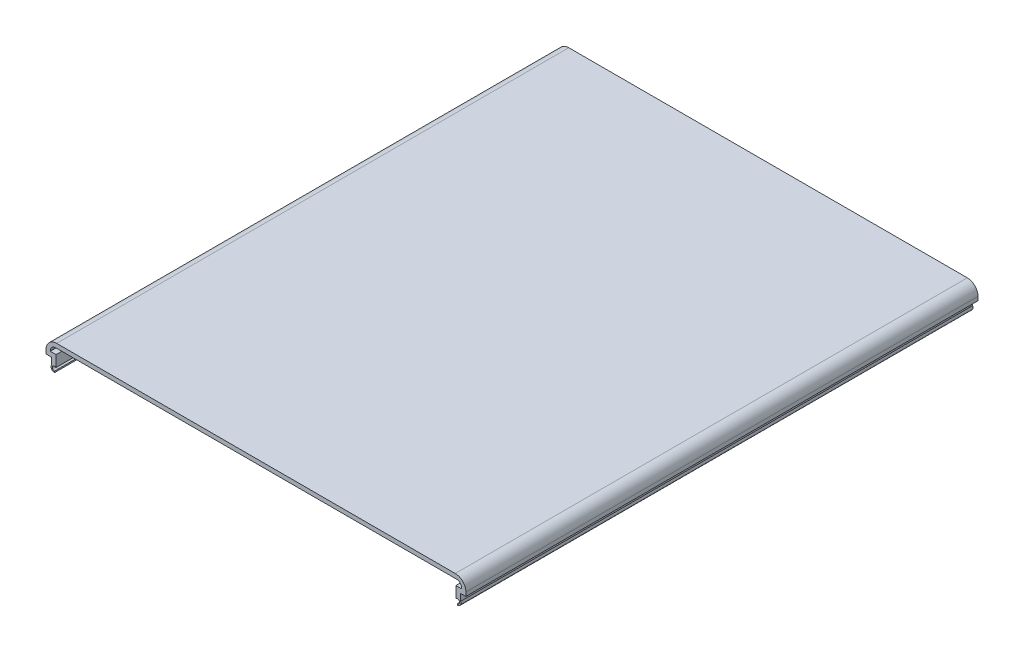
ISO-10303-21;
HEADER;
FILE_DESCRIPTION(('STEP AP214'),'2;1');
FILE_NAME('part.step','',(''),(''),'','','');
FILE_SCHEMA(('AUTOMOTIVE_DESIGN { 1 0 10303 214 1 1 1 1 }'));
ENDSEC;
DATA;
#1=APPLICATION_CONTEXT('core data for automotive mechanical design processes');
#2=APPLICATION_PROTOCOL_DEFINITION('international standard','automotive_design',2000,#1);
#3=PRODUCT_CONTEXT('',#1,'mechanical');
#4=PRODUCT('Part','Part','',(#3));
#5=PRODUCT_RELATED_PRODUCT_CATEGORY('part','',(#4));
#6=PRODUCT_DEFINITION_FORMATION('','',#4);
#7=PRODUCT_DEFINITION_CONTEXT('part definition',#1,'design');
#8=PRODUCT_DEFINITION('design','',#6,#7);
#9=PRODUCT_DEFINITION_SHAPE('','',#8);
#10=(LENGTH_UNIT() NAMED_UNIT(*) SI_UNIT(.MILLI.,.METRE.));
#11=(NAMED_UNIT(*) PLANE_ANGLE_UNIT() SI_UNIT($,.RADIAN.));
#12=(NAMED_UNIT(*) SI_UNIT($,.STERADIAN.) SOLID_ANGLE_UNIT());
#13=UNCERTAINTY_MEASURE_WITH_UNIT(LENGTH_MEASURE(1.E-05),#10,'distance_accuracy_value','');
#14=(GEOMETRIC_REPRESENTATION_CONTEXT(3) GLOBAL_UNCERTAINTY_ASSIGNED_CONTEXT((#13)) GLOBAL_UNIT_ASSIGNED_CONTEXT((#10,
#11,#12)) REPRESENTATION_CONTEXT('',''));
#15=CARTESIAN_POINT('',(0.,0.,0.));
#16=DIRECTION('',(0.,0.,1.));
#17=DIRECTION('',(1.,0.,0.));
#18=AXIS2_PLACEMENT_3D('',#15,#16,#17);
#19=CARTESIAN_POINT('',(-122.428,-6.00422078663732,304.8));
#20=DIRECTION('',(-1.,0.,0.));
#21=DIRECTION('',(0.,0.,1.));
#22=AXIS2_PLACEMENT_3D('',#19,#20,#21);
#23=PLANE('',#22);
#24=DIRECTION('',(0.,1.,0.));
#25=VECTOR('',#24,1.);
#26=CARTESIAN_POINT('',(-122.428,-6.00422078663732,0.));
#27=LINE('',#26,#25);
#28=CARTESIAN_POINT('',(-122.428,-6.00422078663732,0.));
#29=VERTEX_POINT('',#28);
#30=CARTESIAN_POINT('',(-122.428,-5.71500000000003,0.));
#31=VERTEX_POINT('',#30);
#32=EDGE_CURVE('E236',#29,#31,#27,.T.);
#33=ORIENTED_EDGE('',*,*,#32,.T.);
#34=DIRECTION('',(0.,0.,-1.));
#35=VECTOR('',#34,1.);
#36=CARTESIAN_POINT('',(-122.428,-5.71500000000003,304.8));
#37=LINE('',#36,#35);
#38=CARTESIAN_POINT('',(-122.428,-5.71500000000003,304.8));
#39=VERTEX_POINT('',#38);
#40=EDGE_CURVE('E11',#39,#31,#37,.T.);
#41=ORIENTED_EDGE('',*,*,#40,.F.);
#42=DIRECTION('',(0.,1.,0.));
#43=VECTOR('',#42,1.);
#44=CARTESIAN_POINT('',(-122.428,-6.00422078663732,304.8));
#45=LINE('',#44,#43);
#46=CARTESIAN_POINT('',(-122.428,-6.00422078663732,304.8));
#47=VERTEX_POINT('',#46);
#48=EDGE_CURVE('E286',#47,#39,#45,.T.);
#49=ORIENTED_EDGE('',*,*,#48,.F.);
#50=DIRECTION('',(0.,0.,-1.));
#51=VECTOR('',#50,1.);
#52=CARTESIAN_POINT('',(-122.428,-6.00422078663732,304.8));
#53=LINE('',#52,#51);
#54=EDGE_CURVE('E232',#47,#29,#53,.T.);
#55=ORIENTED_EDGE('',*,*,#54,.T.);
#56=EDGE_LOOP('',(#33,#41,#49,#55));
#57=FACE_BOUND('',#56,.T.);
#58=ADVANCED_FACE('F32',(#57),#23,.F.);
#59=CARTESIAN_POINT('',(-119.253,-5.71500000000003,304.8));
#60=DIRECTION('',(0.,0.,-1.));
#61=DIRECTION('',(-1.,0.,0.));
#62=AXIS2_PLACEMENT_3D('',#59,#60,#61);
#63=CYLINDRICAL_SURFACE('',#62,3.17499999999998);
#64=CARTESIAN_POINT('',(-119.253,-5.71500000000003,0.));
#65=DIRECTION('',(0.,0.,-1.));
#66=DIRECTION('',(-1.,0.,0.));
#67=AXIS2_PLACEMENT_3D('',#64,#65,#66);
#68=CIRCLE('',#67,3.17499999999998);
#69=CARTESIAN_POINT('',(-119.253,-2.54000000000006,0.));
#70=VERTEX_POINT('',#69);
#71=EDGE_CURVE('E239',#31,#70,#68,.T.);
#72=ORIENTED_EDGE('',*,*,#71,.T.);
#73=DIRECTION('',(0.,0.,-1.));
#74=VECTOR('',#73,1.);
#75=CARTESIAN_POINT('',(-119.253,-2.54000000000006,304.8));
#76=LINE('',#75,#74);
#77=CARTESIAN_POINT('',(-119.253,-2.54000000000006,304.8));
#78=VERTEX_POINT('',#77);
#79=EDGE_CURVE('E40',#78,#70,#76,.T.);
#80=ORIENTED_EDGE('',*,*,#79,.F.);
#81=CARTESIAN_POINT('',(-119.253,-5.71500000000003,304.8));
#82=DIRECTION('',(0.,0.,-1.));
#83=DIRECTION('',(-1.,0.,0.));
#84=AXIS2_PLACEMENT_3D('',#81,#82,#83);
#85=CIRCLE('',#84,3.17499999999998);
#86=EDGE_CURVE('E145',#39,#78,#85,.T.);
#87=ORIENTED_EDGE('',*,*,#86,.F.);
#88=ORIENTED_EDGE('',*,*,#40,.T.);
#89=EDGE_LOOP('',(#72,#80,#87,#88));
#90=FACE_BOUND('',#89,.T.);
#91=ADVANCED_FACE('F434',(#90),#63,.F.);
#92=CARTESIAN_POINT('',(-119.253,-2.54000000000006,304.8));
#93=DIRECTION('',(0.,1.,0.));
#94=DIRECTION('',(-1.,0.,0.));
#95=AXIS2_PLACEMENT_3D('',#92,#93,#94);
#96=PLANE('',#95);
#97=DIRECTION('',(1.,0.,0.));
#98=VECTOR('',#97,1.);
#99=CARTESIAN_POINT('',(-119.253,-2.54000000000006,0.));
#100=LINE('',#99,#98);
#101=CARTESIAN_POINT('',(119.253,-2.54000000000002,0.));
#102=VERTEX_POINT('',#101);
#103=EDGE_CURVE('E241',#70,#102,#100,.T.);
#104=ORIENTED_EDGE('',*,*,#103,.T.);
#105=DIRECTION('',(0.,0.,-1.));
#106=VECTOR('',#105,1.);
#107=CARTESIAN_POINT('',(119.253,-2.54000000000002,304.8));
#108=LINE('',#107,#106);
#109=CARTESIAN_POINT('',(119.253,-2.54000000000002,304.8));
#110=VERTEX_POINT('',#109);
#111=EDGE_CURVE('E347',#110,#102,#108,.T.);
#112=ORIENTED_EDGE('',*,*,#111,.F.);
#113=DIRECTION('',(1.,0.,0.));
#114=VECTOR('',#113,1.);
#115=CARTESIAN_POINT('',(-119.253,-2.54000000000006,304.8));
#116=LINE('',#115,#114);
#117=EDGE_CURVE('E355',#78,#110,#116,.T.);
#118=ORIENTED_EDGE('',*,*,#117,.F.);
#119=ORIENTED_EDGE('',*,*,#79,.T.);
#120=EDGE_LOOP('',(#104,#112,#118,#119));
#121=FACE_BOUND('',#120,.T.);
#122=ADVANCED_FACE('F353',(#121),#96,.F.);
#123=CARTESIAN_POINT('',(119.253,-5.715,304.8));
#124=DIRECTION('',(0.,0.,-1.));
#125=DIRECTION('',(-1.,0.,0.));
#126=AXIS2_PLACEMENT_3D('',#123,#124,#125);
#127=CYLINDRICAL_SURFACE('',#126,3.17499999999998);
#128=CARTESIAN_POINT('',(119.253,-5.715,0.));
#129=DIRECTION('',(0.,0.,-1.));
#130=DIRECTION('',(1.,0.,0.));
#131=AXIS2_PLACEMENT_3D('',#128,#129,#130);
#132=CIRCLE('',#131,3.17499999999998);
#133=CARTESIAN_POINT('',(122.428,-5.715,0.));
#134=VERTEX_POINT('',#133);
#135=EDGE_CURVE('E243',#102,#134,#132,.T.);
#136=ORIENTED_EDGE('',*,*,#135,.T.);
#137=DIRECTION('',(0.,0.,-1.));
#138=VECTOR('',#137,1.);
#139=CARTESIAN_POINT('',(122.428,-5.715,304.8));
#140=LINE('',#139,#138);
#141=CARTESIAN_POINT('',(122.428,-5.715,304.8));
#142=VERTEX_POINT('',#141);
#143=EDGE_CURVE('E344',#142,#134,#140,.T.);
#144=ORIENTED_EDGE('',*,*,#143,.F.);
#145=CARTESIAN_POINT('',(119.253,-5.715,304.8));
#146=DIRECTION('',(0.,0.,-1.));
#147=DIRECTION('',(1.,0.,0.));
#148=AXIS2_PLACEMENT_3D('',#145,#146,#147);
#149=CIRCLE('',#148,3.17499999999998);
#150=EDGE_CURVE('E373',#110,#142,#149,.T.);
#151=ORIENTED_EDGE('',*,*,#150,.F.);
#152=ORIENTED_EDGE('',*,*,#111,.T.);
#153=EDGE_LOOP('',(#136,#144,#151,#152));
#154=FACE_BOUND('',#153,.T.);
#155=ADVANCED_FACE('F364',(#154),#127,.F.);
#156=CARTESIAN_POINT('',(122.428,-6.00422078663729,304.8));
#157=DIRECTION('',(1.,0.,0.));
#158=DIRECTION('',(0.,0.,-1.));
#159=AXIS2_PLACEMENT_3D('',#156,#157,#158);
#160=PLANE('',#159);
#161=DIRECTION('',(0.,-1.,0.));
#162=VECTOR('',#161,1.);
#163=CARTESIAN_POINT('',(122.428,-6.00422078663729,0.));
#164=LINE('',#163,#162);
#165=CARTESIAN_POINT('',(122.428,-6.00422078663729,0.));
#166=VERTEX_POINT('',#165);
#167=EDGE_CURVE('E245',#134,#166,#164,.T.);
#168=ORIENTED_EDGE('',*,*,#167,.T.);
#169=DIRECTION('',(0.,0.,-1.));
#170=VECTOR('',#169,1.);
#171=CARTESIAN_POINT('',(122.428,-6.00422078663729,304.8));
#172=LINE('',#171,#170);
#173=CARTESIAN_POINT('',(122.428,-6.00422078663729,304.8));
#174=VERTEX_POINT('',#173);
#175=EDGE_CURVE('E341',#174,#166,#172,.T.);
#176=ORIENTED_EDGE('',*,*,#175,.F.);
#177=DIRECTION('',(0.,-1.,0.));
#178=VECTOR('',#177,1.);
#179=CARTESIAN_POINT('',(122.428,-6.00422078663729,304.8));
#180=LINE('',#179,#178);
#181=EDGE_CURVE('E370',#142,#174,#180,.T.);
#182=ORIENTED_EDGE('',*,*,#181,.F.);
#183=ORIENTED_EDGE('',*,*,#143,.T.);
#184=EDGE_LOOP('',(#168,#176,#182,#183));
#185=FACE_BOUND('',#184,.T.);
#186=ADVANCED_FACE('F368',(#185),#160,.F.);
#187=CARTESIAN_POINT('',(118.992266473634,-6.00422078663729,304.8));
#188=DIRECTION('',(0.,-1.,0.));
#189=DIRECTION('',(0.,0.,-1.));
#190=AXIS2_PLACEMENT_3D('',#187,#188,#189);
#191=PLANE('',#190);
#192=DIRECTION('',(-1.,0.,0.));
#193=VECTOR('',#192,1.);
#194=CARTESIAN_POINT('',(118.992266473634,-6.00422078663729,0.));
#195=LINE('',#194,#193);
#196=CARTESIAN_POINT('',(118.992266473634,-6.00422078663729,0.));
#197=VERTEX_POINT('',#196);
#198=EDGE_CURVE('E247',#166,#197,#195,.T.);
#199=ORIENTED_EDGE('',*,*,#198,.T.);
#200=DIRECTION('',(0.,0.,-1.));
#201=VECTOR('',#200,1.);
#202=CARTESIAN_POINT('',(118.992266473634,-6.00422078663729,304.8));
#203=LINE('',#202,#201);
#204=CARTESIAN_POINT('',(118.992266473634,-6.00422078663729,304.8));
#205=VERTEX_POINT('',#204);
#206=EDGE_CURVE('E338',#205,#197,#203,.T.);
#207=ORIENTED_EDGE('',*,*,#206,.F.);
#208=DIRECTION('',(-1.,0.,0.));
#209=VECTOR('',#208,1.);
#210=CARTESIAN_POINT('',(118.992266473634,-6.00422078663729,304.8));
#211=LINE('',#210,#209);
#212=EDGE_CURVE('E372',#174,#205,#211,.T.);
#213=ORIENTED_EDGE('',*,*,#212,.F.);
#214=ORIENTED_EDGE('',*,*,#175,.T.);
#215=EDGE_LOOP('',(#199,#207,#213,#214));
#216=FACE_BOUND('',#215,.T.);
#217=ADVANCED_FACE('F447',(#216),#191,.F.);
#218=CARTESIAN_POINT('',(118.992266473634,-12.6219946945985,304.8));
#219=DIRECTION('',(1.,0.,0.));
#220=DIRECTION('',(0.,0.,-1.));
#221=AXIS2_PLACEMENT_3D('',#218,#219,#220);
#222=PLANE('',#221);
#223=DIRECTION('',(0.,-1.,0.));
#224=VECTOR('',#223,1.);
#225=CARTESIAN_POINT('',(118.992266473634,-12.6219946945985,0.));
#226=LINE('',#225,#224);
#227=CARTESIAN_POINT('',(118.992266473634,-12.6219946945985,0.));
#228=VERTEX_POINT('',#227);
#229=EDGE_CURVE('E249',#197,#228,#226,.T.);
#230=ORIENTED_EDGE('',*,*,#229,.T.);
#231=DIRECTION('',(0.,0.,-1.));
#232=VECTOR('',#231,1.);
#233=CARTESIAN_POINT('',(118.992266473634,-12.6219946945985,304.8));
#234=LINE('',#233,#232);
#235=CARTESIAN_POINT('',(118.992266473634,-12.6219946945985,304.8));
#236=VERTEX_POINT('',#235);
#237=EDGE_CURVE('E335',#236,#228,#234,.T.);
#238=ORIENTED_EDGE('',*,*,#237,.F.);
#239=DIRECTION('',(0.,-1.,0.));
#240=VECTOR('',#239,1.);
#241=CARTESIAN_POINT('',(118.992266473634,-12.6219946945985,304.8));
#242=LINE('',#241,#240);
#243=EDGE_CURVE('E375',#205,#236,#242,.T.);
#244=ORIENTED_EDGE('',*,*,#243,.F.);
#245=ORIENTED_EDGE('',*,*,#206,.T.);
#246=EDGE_LOOP('',(#230,#238,#244,#245));
#247=FACE_BOUND('',#246,.T.);
#248=ADVANCED_FACE('F450',(#247),#222,.F.);
#249=CARTESIAN_POINT('',(119.146762684132,-12.6219946945985,304.8));
#250=DIRECTION('',(0.,1.,0.));
#251=DIRECTION('',(0.,0.,1.));
#252=AXIS2_PLACEMENT_3D('',#249,#250,#251);
#253=PLANE('',#252);
#254=DIRECTION('',(1.,0.,0.));
#255=VECTOR('',#254,1.);
#256=CARTESIAN_POINT('',(119.146762684132,-12.6219946945985,0.));
#257=LINE('',#256,#255);
#258=CARTESIAN_POINT('',(119.146762684132,-12.6219946945986,0.));
#259=VERTEX_POINT('',#258);
#260=EDGE_CURVE('E251',#228,#259,#257,.T.);
#261=ORIENTED_EDGE('',*,*,#260,.T.);
#262=DIRECTION('',(0.,0.,-1.));
#263=VECTOR('',#262,1.);
#264=CARTESIAN_POINT('',(119.146762684132,-12.6219946945986,304.8));
#265=LINE('',#264,#263);
#266=CARTESIAN_POINT('',(119.146762684132,-12.6219946945986,304.8));
#267=VERTEX_POINT('',#266);
#268=EDGE_CURVE('E332',#267,#259,#265,.T.);
#269=ORIENTED_EDGE('',*,*,#268,.F.);
#270=DIRECTION('',(1.,0.,0.));
#271=VECTOR('',#270,1.);
#272=CARTESIAN_POINT('',(119.146762684132,-12.6219946945985,304.8));
#273=LINE('',#272,#271);
#274=EDGE_CURVE('E381',#236,#267,#273,.T.);
#275=ORIENTED_EDGE('',*,*,#274,.F.);
#276=ORIENTED_EDGE('',*,*,#237,.T.);
#277=EDGE_LOOP('',(#261,#269,#275,#276));
#278=FACE_BOUND('',#277,.T.);
#279=ADVANCED_FACE('F454',(#278),#253,.F.);
#280=CARTESIAN_POINT('',(119.888,-13.653240175347,304.8));
#281=DIRECTION('',(0.,0.,-1.));
#282=DIRECTION('',(-1.,0.,0.));
#283=AXIS2_PLACEMENT_3D('',#280,#281,#282);
#284=CYLINDRICAL_SURFACE('',#283,1.27);
#285=CARTESIAN_POINT('',(119.888,-13.653240175347,0.));
#286=DIRECTION('',(0.,0.,-1.));
#287=DIRECTION('',(1.,0.,0.));
#288=AXIS2_PLACEMENT_3D('',#285,#286,#287);
#289=CIRCLE('',#288,1.27);
#290=CARTESIAN_POINT('',(119.881210728142,-14.9232220278897,0.));
#291=VERTEX_POINT('',#290);
#292=EDGE_CURVE('E253',#259,#291,#289,.T.);
#293=ORIENTED_EDGE('',*,*,#292,.T.);
#294=DIRECTION('',(0.,0.,-1.));
#295=VECTOR('',#294,1.);
#296=CARTESIAN_POINT('',(119.881210728142,-14.9232220278897,304.8));
#297=LINE('',#296,#295);
#298=CARTESIAN_POINT('',(119.881210728142,-14.9232220278897,304.8));
#299=VERTEX_POINT('',#298);
#300=EDGE_CURVE('E329',#299,#291,#297,.T.);
#301=ORIENTED_EDGE('',*,*,#300,.F.);
#302=CARTESIAN_POINT('',(119.888,-13.653240175347,304.8));
#303=DIRECTION('',(0.,0.,-1.));
#304=DIRECTION('',(1.,0.,0.));
#305=AXIS2_PLACEMENT_3D('',#302,#303,#304);
#306=CIRCLE('',#305,1.27);
#307=EDGE_CURVE('E383',#267,#299,#306,.T.);
#308=ORIENTED_EDGE('',*,*,#307,.F.);
#309=ORIENTED_EDGE('',*,*,#268,.T.);
#310=EDGE_LOOP('',(#293,#301,#308,#309));
#311=FACE_BOUND('',#310,.T.);
#312=ADVANCED_FACE('F458',(#311),#284,.F.);
#313=CARTESIAN_POINT('',(119.888,-15.748740175347,304.8));
#314=DIRECTION('',(0.999966182529296,0.00822397700554112,0.));
#315=DIRECTION('',(-0.00822397700554112,0.999966182529296,0.));
#316=AXIS2_PLACEMENT_3D('',#313,#314,#315);
#317=PLANE('',#316);
#318=DIRECTION('',(0.00822397700554112,-0.999966182529295,0.));
#319=VECTOR('',#318,1.);
#320=CARTESIAN_POINT('',(119.888,-15.748740175347,0.));
#321=LINE('',#320,#319);
#322=CARTESIAN_POINT('',(119.888,-15.748740175347,0.));
#323=VERTEX_POINT('',#322);
#324=EDGE_CURVE('E255',#291,#323,#321,.T.);
#325=ORIENTED_EDGE('',*,*,#324,.T.);
#326=DIRECTION('',(0.,0.,-1.));
#327=VECTOR('',#326,1.);
#328=CARTESIAN_POINT('',(119.888,-15.748740175347,304.8));
#329=LINE('',#328,#327);
#330=CARTESIAN_POINT('',(119.888,-15.748740175347,304.8));
#331=VERTEX_POINT('',#330);
#332=EDGE_CURVE('E326',#331,#323,#329,.T.);
#333=ORIENTED_EDGE('',*,*,#332,.F.);
#334=DIRECTION('',(0.00822397700554112,-0.999966182529295,0.));
#335=VECTOR('',#334,1.);
#336=CARTESIAN_POINT('',(119.888,-15.748740175347,304.8));
#337=LINE('',#336,#335);
#338=EDGE_CURVE('E385',#299,#331,#337,.T.);
#339=ORIENTED_EDGE('',*,*,#338,.F.);
#340=ORIENTED_EDGE('',*,*,#300,.T.);
#341=EDGE_LOOP('',(#325,#333,#339,#340));
#342=FACE_BOUND('',#341,.T.);
#343=ADVANCED_FACE('F462',(#342),#317,.F.);
#344=CARTESIAN_POINT('',(119.888,-13.653240175347,304.8));
#345=DIRECTION('',(0.,0.,-1.));
#346=DIRECTION('',(-1.,0.,0.));
#347=AXIS2_PLACEMENT_3D('',#344,#345,#346);
#348=CYLINDRICAL_SURFACE('',#347,2.09549999999999);
#349=CARTESIAN_POINT('',(119.888,-13.653240175347,0.));
#350=DIRECTION('',(0.,0.,1.));
#351=DIRECTION('',(-1.,0.,0.));
#352=AXIS2_PLACEMENT_3D('',#349,#350,#351);
#353=CIRCLE('',#352,2.09549999999999);
#354=CARTESIAN_POINT('',(121.793,-12.7802595054579,0.));
#355=VERTEX_POINT('',#354);
#356=EDGE_CURVE('E257',#323,#355,#353,.T.);
#357=ORIENTED_EDGE('',*,*,#356,.T.);
#358=DIRECTION('',(0.,0.,-1.));
#359=VECTOR('',#358,1.);
#360=CARTESIAN_POINT('',(121.793,-12.7802595054579,304.8));
#361=LINE('',#360,#359);
#362=CARTESIAN_POINT('',(121.793,-12.7802595054579,304.8));
#363=VERTEX_POINT('',#362);
#364=EDGE_CURVE('E323',#363,#355,#361,.T.);
#365=ORIENTED_EDGE('',*,*,#364,.F.);
#366=CARTESIAN_POINT('',(119.888,-13.653240175347,304.8));
#367=DIRECTION('',(0.,0.,1.));
#368=DIRECTION('',(-1.,0.,0.));
#369=AXIS2_PLACEMENT_3D('',#366,#367,#368);
#370=CIRCLE('',#369,2.09549999999999);
#371=EDGE_CURVE('E387',#331,#363,#370,.T.);
#372=ORIENTED_EDGE('',*,*,#371,.F.);
#373=ORIENTED_EDGE('',*,*,#332,.T.);
#374=EDGE_LOOP('',(#357,#365,#372,#373));
#375=FACE_BOUND('',#374,.T.);
#376=ADVANCED_FACE('F466',(#375),#348,.T.);
#377=CARTESIAN_POINT('',(121.793,-8.66545950545794,304.8));
#378=DIRECTION('',(-1.,0.,0.));
#379=DIRECTION('',(0.,0.,1.));
#380=AXIS2_PLACEMENT_3D('',#377,#378,#379);
#381=PLANE('',#380);
#382=DIRECTION('',(0.,1.,0.));
#383=VECTOR('',#382,1.);
#384=CARTESIAN_POINT('',(121.793,-8.66545950545794,0.));
#385=LINE('',#384,#383);
#386=CARTESIAN_POINT('',(121.793,-8.66545950545794,0.));
#387=VERTEX_POINT('',#386);
#388=EDGE_CURVE('E259',#355,#387,#385,.T.);
#389=ORIENTED_EDGE('',*,*,#388,.T.);
#390=DIRECTION('',(0.,0.,-1.));
#391=VECTOR('',#390,1.);
#392=CARTESIAN_POINT('',(121.793,-8.66545950545794,304.8));
#393=LINE('',#392,#391);
#394=CARTESIAN_POINT('',(121.793,-8.66545950545794,304.8));
#395=VERTEX_POINT('',#394);
#396=EDGE_CURVE('E320',#395,#387,#393,.T.);
#397=ORIENTED_EDGE('',*,*,#396,.F.);
#398=DIRECTION('',(0.,1.,0.));
#399=VECTOR('',#398,1.);
#400=CARTESIAN_POINT('',(121.793,-8.66545950545794,304.8));
#401=LINE('',#400,#399);
#402=EDGE_CURVE('E389',#363,#395,#401,.T.);
#403=ORIENTED_EDGE('',*,*,#402,.F.);
#404=ORIENTED_EDGE('',*,*,#364,.T.);
#405=EDGE_LOOP('',(#389,#397,#403,#404));
#406=FACE_BOUND('',#405,.T.);
#407=ADVANCED_FACE('F470',(#406),#381,.F.);
#408=CARTESIAN_POINT('',(124.968,-8.66545950545794,304.8));
#409=DIRECTION('',(0.,1.,0.));
#410=DIRECTION('',(0.,0.,1.));
#411=AXIS2_PLACEMENT_3D('',#408,#409,#410);
#412=PLANE('',#411);
#413=DIRECTION('',(1.,0.,0.));
#414=VECTOR('',#413,1.);
#415=CARTESIAN_POINT('',(124.968,-8.66545950545794,0.));
#416=LINE('',#415,#414);
#417=CARTESIAN_POINT('',(124.968,-8.66545950545794,0.));
#418=VERTEX_POINT('',#417);
#419=EDGE_CURVE('E261',#387,#418,#416,.T.);
#420=ORIENTED_EDGE('',*,*,#419,.T.);
#421=DIRECTION('',(0.,0.,-1.));
#422=VECTOR('',#421,1.);
#423=CARTESIAN_POINT('',(124.968,-8.66545950545794,304.8));
#424=LINE('',#423,#422);
#425=CARTESIAN_POINT('',(124.968,-8.66545950545794,304.8));
#426=VERTEX_POINT('',#425);
#427=EDGE_CURVE('E317',#426,#418,#424,.T.);
#428=ORIENTED_EDGE('',*,*,#427,.F.);
#429=DIRECTION('',(1.,0.,0.));
#430=VECTOR('',#429,1.);
#431=CARTESIAN_POINT('',(124.968,-8.66545950545794,304.8));
#432=LINE('',#431,#430);
#433=EDGE_CURVE('E391',#395,#426,#432,.T.);
#434=ORIENTED_EDGE('',*,*,#433,.F.);
#435=ORIENTED_EDGE('',*,*,#396,.T.);
#436=EDGE_LOOP('',(#420,#428,#434,#435));
#437=FACE_BOUND('',#436,.T.);
#438=ADVANCED_FACE('F474',(#437),#412,.F.);
#439=CARTESIAN_POINT('',(124.968,-6.35000000000001,304.8));
#440=DIRECTION('',(-1.,0.,0.));
#441=DIRECTION('',(0.,-1.,0.));
#442=AXIS2_PLACEMENT_3D('',#439,#440,#441);
#443=PLANE('',#442);
#444=DIRECTION('',(0.,1.,0.));
#445=VECTOR('',#444,1.);
#446=CARTESIAN_POINT('',(124.968,-6.35000000000001,0.));
#447=LINE('',#446,#445);
#448=CARTESIAN_POINT('',(124.968,-6.35000000000002,0.));
#449=VERTEX_POINT('',#448);
#450=EDGE_CURVE('E263',#418,#449,#447,.T.);
#451=ORIENTED_EDGE('',*,*,#450,.T.);
#452=DIRECTION('',(0.,0.,-1.));
#453=VECTOR('',#452,1.);
#454=CARTESIAN_POINT('',(124.968,-6.35000000000002,304.8));
#455=LINE('',#454,#453);
#456=CARTESIAN_POINT('',(124.968,-6.35000000000002,304.8));
#457=VERTEX_POINT('',#456);
#458=EDGE_CURVE('E314',#457,#449,#455,.T.);
#459=ORIENTED_EDGE('',*,*,#458,.F.);
#460=DIRECTION('',(0.,1.,0.));
#461=VECTOR('',#460,1.);
#462=CARTESIAN_POINT('',(124.968,-6.35000000000001,304.8));
#463=LINE('',#462,#461);
#464=EDGE_CURVE('E393',#426,#457,#463,.T.);
#465=ORIENTED_EDGE('',*,*,#464,.F.);
#466=ORIENTED_EDGE('',*,*,#427,.T.);
#467=EDGE_LOOP('',(#451,#459,#465,#466));
#468=FACE_BOUND('',#467,.T.);
#469=ADVANCED_FACE('F478',(#468),#443,.F.);
#470=CARTESIAN_POINT('',(118.618,-6.34999999999997,304.8));
#471=DIRECTION('',(0.,0.,-1.));
#472=DIRECTION('',(-1.,0.,0.));
#473=AXIS2_PLACEMENT_3D('',#470,#471,#472);
#474=CYLINDRICAL_SURFACE('',#473,6.35);
#475=CARTESIAN_POINT('',(118.618,-6.34999999999997,0.));
#476=DIRECTION('',(0.,0.,1.));
#477=DIRECTION('',(1.,0.,0.));
#478=AXIS2_PLACEMENT_3D('',#475,#476,#477);
#479=CIRCLE('',#478,6.35);
#480=CARTESIAN_POINT('',(118.618,0.,0.));
#481=VERTEX_POINT('',#480);
#482=EDGE_CURVE('E265',#449,#481,#479,.T.);
#483=ORIENTED_EDGE('',*,*,#482,.T.);
#484=DIRECTION('',(0.,0.,-1.));
#485=VECTOR('',#484,1.);
#486=CARTESIAN_POINT('',(118.618,0.,304.8));
#487=LINE('',#486,#485);
#488=CARTESIAN_POINT('',(118.618,0.,304.8));
#489=VERTEX_POINT('',#488);
#490=EDGE_CURVE('E311',#489,#481,#487,.T.);
#491=ORIENTED_EDGE('',*,*,#490,.F.);
#492=CARTESIAN_POINT('',(118.618,-6.34999999999997,304.8));
#493=DIRECTION('',(0.,0.,1.));
#494=DIRECTION('',(1.,0.,0.));
#495=AXIS2_PLACEMENT_3D('',#492,#493,#494);
#496=CIRCLE('',#495,6.35);
#497=EDGE_CURVE('E395',#457,#489,#496,.T.);
#498=ORIENTED_EDGE('',*,*,#497,.F.);
#499=ORIENTED_EDGE('',*,*,#458,.T.);
#500=EDGE_LOOP('',(#483,#491,#498,#499));
#501=FACE_BOUND('',#500,.T.);
#502=ADVANCED_FACE('F482',(#501),#474,.T.);
#503=CARTESIAN_POINT('',(-118.618,0.,304.8));
#504=DIRECTION('',(0.,-1.,0.));
#505=DIRECTION('',(1.,0.,0.));
#506=AXIS2_PLACEMENT_3D('',#503,#504,#505);
#507=PLANE('',#506);
#508=DIRECTION('',(-1.,0.,0.));
#509=VECTOR('',#508,1.);
#510=CARTESIAN_POINT('',(-118.618,0.,0.));
#511=LINE('',#510,#509);
#512=CARTESIAN_POINT('',(-118.618,0.,0.));
#513=VERTEX_POINT('',#512);
#514=EDGE_CURVE('E267',#481,#513,#511,.T.);
#515=ORIENTED_EDGE('',*,*,#514,.T.);
#516=DIRECTION('',(0.,0.,-1.));
#517=VECTOR('',#516,1.);
#518=CARTESIAN_POINT('',(-118.618,0.,304.8));
#519=LINE('',#518,#517);
#520=CARTESIAN_POINT('',(-118.618,0.,304.8));
#521=VERTEX_POINT('',#520);
#522=EDGE_CURVE('E308',#521,#513,#519,.T.);
#523=ORIENTED_EDGE('',*,*,#522,.F.);
#524=DIRECTION('',(-1.,0.,0.));
#525=VECTOR('',#524,1.);
#526=CARTESIAN_POINT('',(-118.618,0.,304.8));
#527=LINE('',#526,#525);
#528=EDGE_CURVE('E397',#489,#521,#527,.T.);
#529=ORIENTED_EDGE('',*,*,#528,.F.);
#530=ORIENTED_EDGE('',*,*,#490,.T.);
#531=EDGE_LOOP('',(#515,#523,#529,#530));
#532=FACE_BOUND('',#531,.T.);
#533=ADVANCED_FACE('F486',(#532),#507,.F.);
#534=CARTESIAN_POINT('',(-118.618,-6.35,304.8));
#535=DIRECTION('',(0.,0.,-1.));
#536=DIRECTION('',(-1.,0.,0.));
#537=AXIS2_PLACEMENT_3D('',#534,#535,#536);
#538=CYLINDRICAL_SURFACE('',#537,6.35);
#539=CARTESIAN_POINT('',(-118.618,-6.35,0.));
#540=DIRECTION('',(0.,0.,1.));
#541=DIRECTION('',(-1.,0.,0.));
#542=AXIS2_PLACEMENT_3D('',#539,#540,#541);
#543=CIRCLE('',#542,6.35);
#544=CARTESIAN_POINT('',(-124.968,-6.35000000000004,0.));
#545=VERTEX_POINT('',#544);
#546=EDGE_CURVE('E269',#513,#545,#543,.T.);
#547=ORIENTED_EDGE('',*,*,#546,.T.);
#548=DIRECTION('',(0.,0.,-1.));
#549=VECTOR('',#548,1.);
#550=CARTESIAN_POINT('',(-124.968,-6.35000000000004,304.8));
#551=LINE('',#550,#549);
#552=CARTESIAN_POINT('',(-124.968,-6.35000000000004,304.8));
#553=VERTEX_POINT('',#552);
#554=EDGE_CURVE('E305',#553,#545,#551,.T.);
#555=ORIENTED_EDGE('',*,*,#554,.F.);
#556=CARTESIAN_POINT('',(-118.618,-6.35,304.8));
#557=DIRECTION('',(0.,0.,1.));
#558=DIRECTION('',(-1.,0.,0.));
#559=AXIS2_PLACEMENT_3D('',#556,#557,#558);
#560=CIRCLE('',#559,6.35);
#561=EDGE_CURVE('E399',#521,#553,#560,.T.);
#562=ORIENTED_EDGE('',*,*,#561,.F.);
#563=ORIENTED_EDGE('',*,*,#522,.T.);
#564=EDGE_LOOP('',(#547,#555,#562,#563));
#565=FACE_BOUND('',#564,.T.);
#566=ADVANCED_FACE('F490',(#565),#538,.T.);
#567=CARTESIAN_POINT('',(-124.968,-6.35000000000004,304.8));
#568=DIRECTION('',(1.,0.,0.));
#569=DIRECTION('',(0.,1.,0.));
#570=AXIS2_PLACEMENT_3D('',#567,#568,#569);
#571=PLANE('',#570);
#572=DIRECTION('',(0.,-1.,0.));
#573=VECTOR('',#572,1.);
#574=CARTESIAN_POINT('',(-124.968,-6.35000000000004,0.));
#575=LINE('',#574,#573);
#576=CARTESIAN_POINT('',(-124.968,-8.66545950545797,0.));
#577=VERTEX_POINT('',#576);
#578=EDGE_CURVE('E271',#545,#577,#575,.T.);
#579=ORIENTED_EDGE('',*,*,#578,.T.);
#580=DIRECTION('',(0.,0.,-1.));
#581=VECTOR('',#580,1.);
#582=CARTESIAN_POINT('',(-124.968,-8.66545950545797,304.8));
#583=LINE('',#582,#581);
#584=CARTESIAN_POINT('',(-124.968,-8.66545950545797,304.8));
#585=VERTEX_POINT('',#584);
#586=EDGE_CURVE('E302',#585,#577,#583,.T.);
#587=ORIENTED_EDGE('',*,*,#586,.F.);
#588=DIRECTION('',(0.,-1.,0.));
#589=VECTOR('',#588,1.);
#590=CARTESIAN_POINT('',(-124.968,-6.35000000000004,304.8));
#591=LINE('',#590,#589);
#592=EDGE_CURVE('E401',#553,#585,#591,.T.);
#593=ORIENTED_EDGE('',*,*,#592,.F.);
#594=ORIENTED_EDGE('',*,*,#554,.T.);
#595=EDGE_LOOP('',(#579,#587,#593,#594));
#596=FACE_BOUND('',#595,.T.);
#597=ADVANCED_FACE('F494',(#596),#571,.F.);
#598=CARTESIAN_POINT('',(-124.968,-8.66545950545797,304.8));
#599=DIRECTION('',(0.,1.,0.));
#600=DIRECTION('',(0.,0.,1.));
#601=AXIS2_PLACEMENT_3D('',#598,#599,#600);
#602=PLANE('',#601);
#603=DIRECTION('',(1.,0.,0.));
#604=VECTOR('',#603,1.);
#605=CARTESIAN_POINT('',(-124.968,-8.66545950545797,0.));
#606=LINE('',#605,#604);
#607=CARTESIAN_POINT('',(-121.793,-8.66545950545797,0.));
#608=VERTEX_POINT('',#607);
#609=EDGE_CURVE('E273',#577,#608,#606,.T.);
#610=ORIENTED_EDGE('',*,*,#609,.T.);
#611=DIRECTION('',(0.,0.,-1.));
#612=VECTOR('',#611,1.);
#613=CARTESIAN_POINT('',(-121.793,-8.66545950545797,304.8));
#614=LINE('',#613,#612);
#615=CARTESIAN_POINT('',(-121.793,-8.66545950545797,304.8));
#616=VERTEX_POINT('',#615);
#617=EDGE_CURVE('E299',#616,#608,#614,.T.);
#618=ORIENTED_EDGE('',*,*,#617,.F.);
#619=DIRECTION('',(1.,0.,0.));
#620=VECTOR('',#619,1.);
#621=CARTESIAN_POINT('',(-124.968,-8.66545950545797,304.8));
#622=LINE('',#621,#620);
#623=EDGE_CURVE('E403',#585,#616,#622,.T.);
#624=ORIENTED_EDGE('',*,*,#623,.F.);
#625=ORIENTED_EDGE('',*,*,#586,.T.);
#626=EDGE_LOOP('',(#610,#618,#624,#625));
#627=FACE_BOUND('',#626,.T.);
#628=ADVANCED_FACE('F498',(#627),#602,.F.);
#629=CARTESIAN_POINT('',(-121.793,-8.66545950545797,304.8));
#630=DIRECTION('',(1.,0.,0.));
#631=DIRECTION('',(0.,0.,-1.));
#632=AXIS2_PLACEMENT_3D('',#629,#630,#631);
#633=PLANE('',#632);
#634=DIRECTION('',(0.,-1.,0.));
#635=VECTOR('',#634,1.);
#636=CARTESIAN_POINT('',(-121.793,-8.66545950545797,0.));
#637=LINE('',#636,#635);
#638=CARTESIAN_POINT('',(-121.793,-12.780259505458,0.));
#639=VERTEX_POINT('',#638);
#640=EDGE_CURVE('E275',#608,#639,#637,.T.);
#641=ORIENTED_EDGE('',*,*,#640,.T.);
#642=DIRECTION('',(0.,0.,-1.));
#643=VECTOR('',#642,1.);
#644=CARTESIAN_POINT('',(-121.793,-12.780259505458,304.8));
#645=LINE('',#644,#643);
#646=CARTESIAN_POINT('',(-121.793,-12.780259505458,304.8));
#647=VERTEX_POINT('',#646);
#648=EDGE_CURVE('E296',#647,#639,#645,.T.);
#649=ORIENTED_EDGE('',*,*,#648,.F.);
#650=DIRECTION('',(0.,-1.,0.));
#651=VECTOR('',#650,1.);
#652=CARTESIAN_POINT('',(-121.793,-8.66545950545797,304.8));
#653=LINE('',#652,#651);
#654=EDGE_CURVE('E405',#616,#647,#653,.T.);
#655=ORIENTED_EDGE('',*,*,#654,.F.);
#656=ORIENTED_EDGE('',*,*,#617,.T.);
#657=EDGE_LOOP('',(#641,#649,#655,#656));
#658=FACE_BOUND('',#657,.T.);
#659=ADVANCED_FACE('F502',(#658),#633,.F.);
#660=CARTESIAN_POINT('',(-119.888,-13.653240175347,304.8));
#661=DIRECTION('',(0.,0.,-1.));
#662=DIRECTION('',(-1.,0.,0.));
#663=AXIS2_PLACEMENT_3D('',#660,#661,#662);
#664=CYLINDRICAL_SURFACE('',#663,2.09549999999999);
#665=CARTESIAN_POINT('',(-119.888,-13.653240175347,0.));
#666=DIRECTION('',(0.,0.,1.));
#667=DIRECTION('',(1.,0.,0.));
#668=AXIS2_PLACEMENT_3D('',#665,#666,#667);
#669=CIRCLE('',#668,2.09549999999999);
#670=CARTESIAN_POINT('',(-119.888,-15.7487401753471,0.));
#671=VERTEX_POINT('',#670);
#672=EDGE_CURVE('E277',#639,#671,#669,.T.);
#673=ORIENTED_EDGE('',*,*,#672,.T.);
#674=DIRECTION('',(0.,0.,-1.));
#675=VECTOR('',#674,1.);
#676=CARTESIAN_POINT('',(-119.888,-15.7487401753471,304.8));
#677=LINE('',#676,#675);
#678=CARTESIAN_POINT('',(-119.888,-15.7487401753471,304.8));
#679=VERTEX_POINT('',#678);
#680=EDGE_CURVE('E293',#679,#671,#677,.T.);
#681=ORIENTED_EDGE('',*,*,#680,.F.);
#682=CARTESIAN_POINT('',(-119.888,-13.653240175347,304.8));
#683=DIRECTION('',(0.,0.,1.));
#684=DIRECTION('',(1.,0.,0.));
#685=AXIS2_PLACEMENT_3D('',#682,#683,#684);
#686=CIRCLE('',#685,2.09549999999999);
#687=EDGE_CURVE('E407',#647,#679,#686,.T.);
#688=ORIENTED_EDGE('',*,*,#687,.F.);
#689=ORIENTED_EDGE('',*,*,#648,.T.);
#690=EDGE_LOOP('',(#673,#681,#688,#689));
#691=FACE_BOUND('',#690,.T.);
#692=ADVANCED_FACE('F506',(#691),#664,.T.);
#693=CARTESIAN_POINT('',(-119.888,-15.7487401753471,304.8));
#694=DIRECTION('',(-0.999966182529295,0.00822397700557476,0.));
#695=DIRECTION('',(-0.00822397700557476,-0.999966182529295,0.));
#696=AXIS2_PLACEMENT_3D('',#693,#694,#695);
#697=PLANE('',#696);
#698=DIRECTION('',(0.00822397700557476,0.999966182529295,0.));
#699=VECTOR('',#698,1.);
#700=CARTESIAN_POINT('',(-119.888,-15.7487401753471,0.));
#701=LINE('',#700,#699);
#702=CARTESIAN_POINT('',(-119.881210728142,-14.9232220278897,0.));
#703=VERTEX_POINT('',#702);
#704=EDGE_CURVE('E279',#671,#703,#701,.T.);
#705=ORIENTED_EDGE('',*,*,#704,.T.);
#706=DIRECTION('',(0.,0.,-1.));
#707=VECTOR('',#706,1.);
#708=CARTESIAN_POINT('',(-119.881210728142,-14.9232220278897,304.8));
#709=LINE('',#708,#707);
#710=CARTESIAN_POINT('',(-119.881210728142,-14.9232220278897,304.8));
#711=VERTEX_POINT('',#710);
#712=EDGE_CURVE('E290',#711,#703,#709,.T.);
#713=ORIENTED_EDGE('',*,*,#712,.F.);
#714=DIRECTION('',(0.00822397700557476,0.999966182529295,0.));
#715=VECTOR('',#714,1.);
#716=CARTESIAN_POINT('',(-119.888,-15.7487401753471,304.8));
#717=LINE('',#716,#715);
#718=EDGE_CURVE('E409',#679,#711,#717,.T.);
#719=ORIENTED_EDGE('',*,*,#718,.F.);
#720=ORIENTED_EDGE('',*,*,#680,.T.);
#721=EDGE_LOOP('',(#705,#713,#719,#720));
#722=FACE_BOUND('',#721,.T.);
#723=ADVANCED_FACE('F415',(#722),#697,.F.);
#724=CARTESIAN_POINT('',(-119.888,-13.653240175347,304.8));
#725=DIRECTION('',(0.,0.,-1.));
#726=DIRECTION('',(-1.,0.,0.));
#727=AXIS2_PLACEMENT_3D('',#724,#725,#726);
#728=CYLINDRICAL_SURFACE('',#727,1.27);
#729=CARTESIAN_POINT('',(-119.888,-13.653240175347,0.));
#730=DIRECTION('',(0.,0.,-1.));
#731=DIRECTION('',(-1.,0.,0.));
#732=AXIS2_PLACEMENT_3D('',#729,#730,#731);
#733=CIRCLE('',#732,1.27);
#734=CARTESIAN_POINT('',(-119.146762684132,-12.6219946945986,0.));
#735=VERTEX_POINT('',#734);
#736=EDGE_CURVE('E281',#703,#735,#733,.T.);
#737=ORIENTED_EDGE('',*,*,#736,.T.);
#738=DIRECTION('',(0.,0.,-1.));
#739=VECTOR('',#738,1.);
#740=CARTESIAN_POINT('',(-119.146762684132,-12.6219946945986,304.8));
#741=LINE('',#740,#739);
#742=CARTESIAN_POINT('',(-119.146762684132,-12.6219946945986,304.8));
#743=VERTEX_POINT('',#742);
#744=EDGE_CURVE('E227',#743,#735,#741,.T.);
#745=ORIENTED_EDGE('',*,*,#744,.F.);
#746=CARTESIAN_POINT('',(-119.888,-13.653240175347,304.8));
#747=DIRECTION('',(0.,0.,-1.));
#748=DIRECTION('',(-1.,0.,0.));
#749=AXIS2_PLACEMENT_3D('',#746,#747,#748);
#750=CIRCLE('',#749,1.27);
#751=EDGE_CURVE('E218',#711,#743,#750,.T.);
#752=ORIENTED_EDGE('',*,*,#751,.F.);
#753=ORIENTED_EDGE('',*,*,#712,.T.);
#754=EDGE_LOOP('',(#737,#745,#752,#753));
#755=FACE_BOUND('',#754,.T.);
#756=ADVANCED_FACE('F419',(#755),#728,.F.);
#757=CARTESIAN_POINT('',(-119.146762684132,-12.6219946945986,304.8));
#758=DIRECTION('',(0.,1.,0.));
#759=DIRECTION('',(0.,0.,1.));
#760=AXIS2_PLACEMENT_3D('',#757,#758,#759);
#761=PLANE('',#760);
#762=DIRECTION('',(1.,0.,0.));
#763=VECTOR('',#762,1.);
#764=CARTESIAN_POINT('',(-119.146762684132,-12.6219946945986,0.));
#765=LINE('',#764,#763);
#766=CARTESIAN_POINT('',(-118.992266473634,-12.6219946945986,0.));
#767=VERTEX_POINT('',#766);
#768=EDGE_CURVE('E226',#735,#767,#765,.T.);
#769=ORIENTED_EDGE('',*,*,#768,.T.);
#770=DIRECTION('',(0.,0.,-1.));
#771=VECTOR('',#770,1.);
#772=CARTESIAN_POINT('',(-118.992266473634,-12.6219946945986,304.8));
#773=LINE('',#772,#771);
#774=CARTESIAN_POINT('',(-118.992266473634,-12.6219946945986,304.8));
#775=VERTEX_POINT('',#774);
#776=EDGE_CURVE('E223',#775,#767,#773,.T.);
#777=ORIENTED_EDGE('',*,*,#776,.F.);
#778=DIRECTION('',(1.,0.,0.));
#779=VECTOR('',#778,1.);
#780=CARTESIAN_POINT('',(-119.146762684132,-12.6219946945986,304.8));
#781=LINE('',#780,#779);
#782=EDGE_CURVE('E212',#743,#775,#781,.T.);
#783=ORIENTED_EDGE('',*,*,#782,.F.);
#784=ORIENTED_EDGE('',*,*,#744,.T.);
#785=EDGE_LOOP('',(#769,#777,#783,#784));
#786=FACE_BOUND('',#785,.T.);
#787=ADVANCED_FACE('F224',(#786),#761,.F.);
#788=CARTESIAN_POINT('',(-118.992266473634,-12.6219946945986,304.8));
#789=DIRECTION('',(-1.,0.,0.));
#790=DIRECTION('',(0.,0.,1.));
#791=AXIS2_PLACEMENT_3D('',#788,#789,#790);
#792=PLANE('',#791);
#793=DIRECTION('',(0.,1.,0.));
#794=VECTOR('',#793,1.);
#795=CARTESIAN_POINT('',(-118.992266473634,-12.6219946945986,0.));
#796=LINE('',#795,#794);
#797=CARTESIAN_POINT('',(-118.992266473634,-6.00422078663732,0.));
#798=VERTEX_POINT('',#797);
#799=EDGE_CURVE('E131',#767,#798,#796,.T.);
#800=ORIENTED_EDGE('',*,*,#799,.T.);
#801=DIRECTION('',(0.,0.,-1.));
#802=VECTOR('',#801,1.);
#803=CARTESIAN_POINT('',(-118.992266473634,-6.00422078663732,304.8));
#804=LINE('',#803,#802);
#805=CARTESIAN_POINT('',(-118.992266473634,-6.00422078663732,304.8));
#806=VERTEX_POINT('',#805);
#807=EDGE_CURVE('E228',#806,#798,#804,.T.);
#808=ORIENTED_EDGE('',*,*,#807,.F.);
#809=DIRECTION('',(0.,1.,0.));
#810=VECTOR('',#809,1.);
#811=CARTESIAN_POINT('',(-118.992266473634,-12.6219946945986,304.8));
#812=LINE('',#811,#810);
#813=EDGE_CURVE('E216',#775,#806,#812,.T.);
#814=ORIENTED_EDGE('',*,*,#813,.F.);
#815=ORIENTED_EDGE('',*,*,#776,.T.);
#816=EDGE_LOOP('',(#800,#808,#814,#815));
#817=FACE_BOUND('',#816,.T.);
#818=ADVANCED_FACE('F230',(#817),#792,.F.);
#819=CARTESIAN_POINT('',(-118.992266473634,-6.00422078663732,304.8));
#820=DIRECTION('',(0.,-1.,0.));
#821=DIRECTION('',(0.,0.,-1.));
#822=AXIS2_PLACEMENT_3D('',#819,#820,#821);
#823=PLANE('',#822);
#824=DIRECTION('',(-1.,0.,0.));
#825=VECTOR('',#824,1.);
#826=CARTESIAN_POINT('',(-118.992266473634,-6.00422078663732,0.));
#827=LINE('',#826,#825);
#828=EDGE_CURVE('E137',#798,#29,#827,.T.);
#829=ORIENTED_EDGE('',*,*,#828,.T.);
#830=ORIENTED_EDGE('',*,*,#54,.F.);
#831=DIRECTION('',(-1.,0.,0.));
#832=VECTOR('',#831,1.);
#833=CARTESIAN_POINT('',(-118.992266473634,-6.00422078663732,304.8));
#834=LINE('',#833,#832);
#835=EDGE_CURVE('E48',#806,#47,#834,.T.);
#836=ORIENTED_EDGE('',*,*,#835,.F.);
#837=ORIENTED_EDGE('',*,*,#807,.T.);
#838=EDGE_LOOP('',(#829,#830,#836,#837));
#839=FACE_BOUND('',#838,.T.);
#840=ADVANCED_FACE('F423',(#839),#823,.F.);
#841=CARTESIAN_POINT('',(-119.253,-5.71500000000003,304.8));
#842=DIRECTION('',(0.,0.,-1.));
#843=DIRECTION('',(-1.,0.,0.));
#844=AXIS2_PLACEMENT_3D('',#841,#842,#843);
#845=PLANE('',#844);
#846=ORIENTED_EDGE('',*,*,#48,.T.);
#847=ORIENTED_EDGE('',*,*,#86,.T.);
#848=ORIENTED_EDGE('',*,*,#117,.T.);
#849=ORIENTED_EDGE('',*,*,#150,.T.);
#850=ORIENTED_EDGE('',*,*,#181,.T.);
#851=ORIENTED_EDGE('',*,*,#212,.T.);
#852=ORIENTED_EDGE('',*,*,#243,.T.);
#853=ORIENTED_EDGE('',*,*,#274,.T.);
#854=ORIENTED_EDGE('',*,*,#307,.T.);
#855=ORIENTED_EDGE('',*,*,#338,.T.);
#856=ORIENTED_EDGE('',*,*,#371,.T.);
#857=ORIENTED_EDGE('',*,*,#402,.T.);
#858=ORIENTED_EDGE('',*,*,#433,.T.);
#859=ORIENTED_EDGE('',*,*,#464,.T.);
#860=ORIENTED_EDGE('',*,*,#497,.T.);
#861=ORIENTED_EDGE('',*,*,#528,.T.);
#862=ORIENTED_EDGE('',*,*,#561,.T.);
#863=ORIENTED_EDGE('',*,*,#592,.T.);
#864=ORIENTED_EDGE('',*,*,#623,.T.);
#865=ORIENTED_EDGE('',*,*,#654,.T.);
#866=ORIENTED_EDGE('',*,*,#687,.T.);
#867=ORIENTED_EDGE('',*,*,#718,.T.);
#868=ORIENTED_EDGE('',*,*,#751,.T.);
#869=ORIENTED_EDGE('',*,*,#782,.T.);
#870=ORIENTED_EDGE('',*,*,#813,.T.);
#871=ORIENTED_EDGE('',*,*,#835,.T.);
#872=EDGE_LOOP('',(#846,#847,#848,#849,#850,#851,#852,#853,#854,#855,#856,#857,#858,#859,#860,
#861,#862,#863,#864,#865,#866,#867,#868,#869,#870,#871));
#873=FACE_BOUND('',#872,.T.);
#874=ADVANCED_FACE('F214',(#873),#845,.F.);
#875=CARTESIAN_POINT('',(-119.253,-5.71500000000003,0.));
#876=DIRECTION('',(0.,0.,-1.));
#877=DIRECTION('',(-1.,0.,0.));
#878=AXIS2_PLACEMENT_3D('',#875,#876,#877);
#879=PLANE('',#878);
#880=ORIENTED_EDGE('',*,*,#32,.F.);
#881=ORIENTED_EDGE('',*,*,#828,.F.);
#882=ORIENTED_EDGE('',*,*,#799,.F.);
#883=ORIENTED_EDGE('',*,*,#768,.F.);
#884=ORIENTED_EDGE('',*,*,#736,.F.);
#885=ORIENTED_EDGE('',*,*,#704,.F.);
#886=ORIENTED_EDGE('',*,*,#672,.F.);
#887=ORIENTED_EDGE('',*,*,#640,.F.);
#888=ORIENTED_EDGE('',*,*,#609,.F.);
#889=ORIENTED_EDGE('',*,*,#578,.F.);
#890=ORIENTED_EDGE('',*,*,#546,.F.);
#891=ORIENTED_EDGE('',*,*,#514,.F.);
#892=ORIENTED_EDGE('',*,*,#482,.F.);
#893=ORIENTED_EDGE('',*,*,#450,.F.);
#894=ORIENTED_EDGE('',*,*,#419,.F.);
#895=ORIENTED_EDGE('',*,*,#388,.F.);
#896=ORIENTED_EDGE('',*,*,#356,.F.);
#897=ORIENTED_EDGE('',*,*,#324,.F.);
#898=ORIENTED_EDGE('',*,*,#292,.F.);
#899=ORIENTED_EDGE('',*,*,#260,.F.);
#900=ORIENTED_EDGE('',*,*,#229,.F.);
#901=ORIENTED_EDGE('',*,*,#198,.F.);
#902=ORIENTED_EDGE('',*,*,#167,.F.);
#903=ORIENTED_EDGE('',*,*,#135,.F.);
#904=ORIENTED_EDGE('',*,*,#103,.F.);
#905=ORIENTED_EDGE('',*,*,#71,.F.);
#906=EDGE_LOOP('',(#880,#881,#882,#883,#884,#885,#886,#887,#888,#889,#890,#891,#892,#893,#894,
#895,#896,#897,#898,#899,#900,#901,#902,#903,#904,#905));
#907=FACE_BOUND('',#906,.T.);
#908=ADVANCED_FACE('F359',(#907),#879,.T.);
#909=CLOSED_SHELL('',(#58,#91,#122,#155,#186,#217,#248,#279,#312,#343,#376,#407,#438,#469,#502,
#533,#566,#597,#628,#659,#692,#723,#756,#787,#818,#840,#874,#908));
#910=MANIFOLD_SOLID_BREP('B2',#909);
#911=ADVANCED_BREP_SHAPE_REPRESENTATION('',(#18,#910),#14);
#912=SHAPE_DEFINITION_REPRESENTATION(#9,#911);
ENDSEC;
END-ISO-10303-21;
